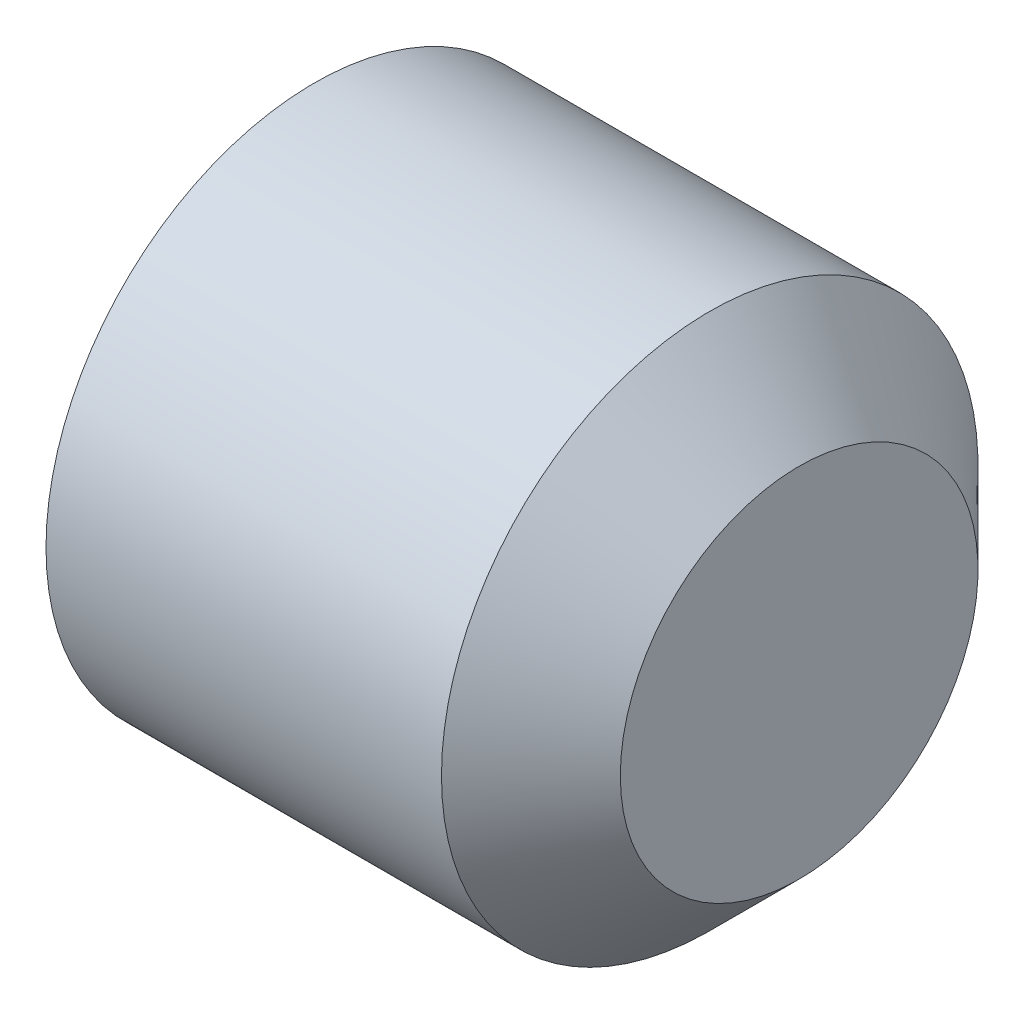
ISO-10303-21;
HEADER;
FILE_DESCRIPTION(('STEP AP214'),'2;1');
FILE_NAME('part.step','',(''),(''),'','','');
FILE_SCHEMA(('AUTOMOTIVE_DESIGN { 1 0 10303 214 1 1 1 1 }'));
ENDSEC;
DATA;
#1=APPLICATION_CONTEXT('core data for automotive mechanical design processes');
#2=APPLICATION_PROTOCOL_DEFINITION('international standard','automotive_design',2000,#1);
#3=PRODUCT_CONTEXT('',#1,'mechanical');
#4=PRODUCT('Part','Part','',(#3));
#5=PRODUCT_RELATED_PRODUCT_CATEGORY('part','',(#4));
#6=PRODUCT_DEFINITION_FORMATION('','',#4);
#7=PRODUCT_DEFINITION_CONTEXT('part definition',#1,'design');
#8=PRODUCT_DEFINITION('design','',#6,#7);
#9=PRODUCT_DEFINITION_SHAPE('','',#8);
#10=(LENGTH_UNIT() NAMED_UNIT(*) SI_UNIT(.MILLI.,.METRE.));
#11=(NAMED_UNIT(*) PLANE_ANGLE_UNIT() SI_UNIT($,.RADIAN.));
#12=(NAMED_UNIT(*) SI_UNIT($,.STERADIAN.) SOLID_ANGLE_UNIT());
#13=UNCERTAINTY_MEASURE_WITH_UNIT(LENGTH_MEASURE(1.E-05),#10,'distance_accuracy_value','');
#14=(GEOMETRIC_REPRESENTATION_CONTEXT(3) GLOBAL_UNCERTAINTY_ASSIGNED_CONTEXT((#13)) GLOBAL_UNIT_ASSIGNED_CONTEXT((#10,
#11,#12)) REPRESENTATION_CONTEXT('',''));
#15=CARTESIAN_POINT('',(0.,0.,0.));
#16=DIRECTION('',(0.,0.,1.));
#17=DIRECTION('',(1.,0.,0.));
#18=AXIS2_PLACEMENT_3D('',#15,#16,#17);
#19=CARTESIAN_POINT('',(0.,0.,0.));
#20=DIRECTION('',(-1.,0.,0.));
#21=DIRECTION('',(0.,0.,1.));
#22=AXIS2_PLACEMENT_3D('',#19,#20,#21);
#23=PLANE('',#22);
#24=DIRECTION('',(0.,0.,-1.));
#25=VECTOR('',#24,1.);
#26=CARTESIAN_POINT('',(0.,1.6,0.866025403784434));
#27=LINE('',#26,#25);
#28=CARTESIAN_POINT('',(0.,1.6,-0.923760430703405));
#29=VERTEX_POINT('',#28);
#30=CARTESIAN_POINT('',(0.,1.6,0.923760430703397));
#31=VERTEX_POINT('',#30);
#32=EDGE_CURVE('E52',#29,#31,#27,.F.);
#33=ORIENTED_EDGE('',*,*,#32,.T.);
#34=DIRECTION('',(0.,0.866025403784438,-0.5));
#35=VECTOR('',#34,1.);
#36=CARTESIAN_POINT('',(0.,0.0500000000000042,1.81865334794732));
#37=LINE('',#36,#35);
#38=CARTESIAN_POINT('',(0.,0.,1.8475208614068));
#39=VERTEX_POINT('',#38);
#40=EDGE_CURVE('E44',#31,#39,#37,.F.);
#41=ORIENTED_EDGE('',*,*,#40,.T.);
#42=DIRECTION('',(0.,0.866025403784439,0.5));
#43=VECTOR('',#42,1.);
#44=CARTESIAN_POINT('',(0.,-1.54999999999999,0.952627944162879));
#45=LINE('',#44,#43);
#46=CARTESIAN_POINT('',(0.,-1.59999999999999,0.923760430703398));
#47=VERTEX_POINT('',#46);
#48=EDGE_CURVE('E184',#39,#47,#45,.F.);
#49=ORIENTED_EDGE('',*,*,#48,.T.);
#50=DIRECTION('',(0.,0.,1.));
#51=VECTOR('',#50,1.);
#52=CARTESIAN_POINT('',(0.,-1.59999999999999,-0.866025403784441));
#53=LINE('',#52,#51);
#54=CARTESIAN_POINT('',(0.,-1.59999999999999,-0.923760430703403));
#55=VERTEX_POINT('',#54);
#56=EDGE_CURVE('E186',#47,#55,#53,.F.);
#57=ORIENTED_EDGE('',*,*,#56,.T.);
#58=DIRECTION('',(0.,-0.866025403784438,0.500000000000001));
#59=VECTOR('',#58,1.);
#60=CARTESIAN_POINT('',(0.,-0.0499999999999965,-1.81865334794732));
#61=LINE('',#60,#59);
#62=CARTESIAN_POINT('',(0.,0.,-1.84752086140681));
#63=VERTEX_POINT('',#62);
#64=EDGE_CURVE('E188',#55,#63,#61,.F.);
#65=ORIENTED_EDGE('',*,*,#64,.T.);
#66=DIRECTION('',(0.,-0.866025403784439,-0.5));
#67=VECTOR('',#66,1.);
#68=CARTESIAN_POINT('',(0.,1.55,-0.952627944162886));
#69=LINE('',#68,#67);
#70=EDGE_CURVE('E57',#63,#29,#69,.F.);
#71=ORIENTED_EDGE('',*,*,#70,.T.);
#72=EDGE_LOOP('',(#33,#41,#49,#57,#65,#71));
#73=FACE_BOUND('',#72,.T.);
#74=CARTESIAN_POINT('',(0.,0.,0.));
#75=DIRECTION('',(-1.,0.,0.));
#76=DIRECTION('',(0.,0.,1.));
#77=AXIS2_PLACEMENT_3D('',#74,#75,#76);
#78=CIRCLE('',#77,1.97320508076302);
#79=CARTESIAN_POINT('',(0.,0.,1.97320508076302));
#80=VERTEX_POINT('',#79);
#81=EDGE_CURVE('E181',#80,#80,#78,.T.);
#82=ORIENTED_EDGE('',*,*,#81,.T.);
#83=EDGE_LOOP('',(#82));
#84=FACE_BOUND('',#83,.T.);
#85=ADVANCED_FACE('F35',(#73,#84),#23,.T.);
#86=CARTESIAN_POINT('',(6.,0.,0.));
#87=DIRECTION('',(-1.,0.,0.));
#88=DIRECTION('',(0.,0.,1.));
#89=AXIS2_PLACEMENT_3D('',#86,#87,#88);
#90=CYLINDRICAL_SURFACE('',#89,3.00000000000659);
#91=CARTESIAN_POINT('',(0.577350269200927,0.,0.));
#92=DIRECTION('',(-1.,0.,0.));
#93=DIRECTION('',(0.,0.,1.));
#94=AXIS2_PLACEMENT_3D('',#91,#92,#93);
#95=CIRCLE('',#94,3.00000000000659);
#96=CARTESIAN_POINT('',(0.577350269200927,0.,3.00000000000659));
#97=VERTEX_POINT('',#96);
#98=EDGE_CURVE('E146',#97,#97,#95,.F.);
#99=ORIENTED_EDGE('',*,*,#98,.T.);
#100=EDGE_LOOP('',(#99));
#101=FACE_BOUND('',#100,.T.);
#102=CARTESIAN_POINT('',(4.99999999999341,0.,0.));
#103=DIRECTION('',(-1.,0.,0.));
#104=DIRECTION('',(0.,0.,1.));
#105=AXIS2_PLACEMENT_3D('',#102,#103,#104);
#106=CIRCLE('',#105,3.00000000000659);
#107=CARTESIAN_POINT('',(4.99999999999341,0.,3.00000000000659));
#108=VERTEX_POINT('',#107);
#109=EDGE_CURVE('E258',#108,#108,#106,.T.);
#110=ORIENTED_EDGE('',*,*,#109,.T.);
#111=EDGE_LOOP('',(#110));
#112=FACE_BOUND('',#111,.T.);
#113=ADVANCED_FACE('F311',(#101,#112),#90,.T.);
#114=CARTESIAN_POINT('',(4.99999999999341,0.,0.));
#115=DIRECTION('',(-1.,0.,0.));
#116=DIRECTION('',(0.,0.,1.));
#117=AXIS2_PLACEMENT_3D('',#114,#115,#116);
#118=CONICAL_SURFACE('',#117,3.00000000000659,0.78539816339745);
#119=CARTESIAN_POINT('',(6.,0.,0.));
#120=DIRECTION('',(-1.,0.,0.));
#121=DIRECTION('',(0.,0.,1.));
#122=AXIS2_PLACEMENT_3D('',#119,#120,#121);
#123=CIRCLE('',#122,2.);
#124=CARTESIAN_POINT('',(6.,0.,2.));
#125=VERTEX_POINT('',#124);
#126=EDGE_CURVE('E255',#125,#125,#123,.T.);
#127=ORIENTED_EDGE('',*,*,#126,.T.);
#128=EDGE_LOOP('',(#127));
#129=FACE_BOUND('',#128,.T.);
#130=ORIENTED_EDGE('',*,*,#109,.F.);
#131=EDGE_LOOP('',(#130));
#132=FACE_BOUND('',#131,.T.);
#133=ADVANCED_FACE('F316',(#129,#132),#118,.T.);
#134=CARTESIAN_POINT('',(6.,2.,0.));
#135=DIRECTION('',(1.,0.,0.));
#136=DIRECTION('',(0.,0.,-1.));
#137=AXIS2_PLACEMENT_3D('',#134,#135,#136);
#138=PLANE('',#137);
#139=ORIENTED_EDGE('',*,*,#126,.F.);
#140=EDGE_LOOP('',(#139));
#141=FACE_BOUND('',#140,.T.);
#142=ADVANCED_FACE('F355',(#141),#138,.T.);
#143=CARTESIAN_POINT('',(2.,-1.49999999999999,0.866025403784435));
#144=DIRECTION('',(0.,-0.5,0.866025403784439));
#145=DIRECTION('',(0.,-0.866025403784439,-0.5));
#146=AXIS2_PLACEMENT_3D('',#143,#144,#145);
#147=PLANE('',#146);
#148=DIRECTION('',(-1.,0.,0.));
#149=VECTOR('',#148,1.);
#150=CARTESIAN_POINT('',(2.,0.,1.73205080756887));
#151=LINE('',#150,#149);
#152=CARTESIAN_POINT('',(1.9,0.,1.73205080756887));
#153=VERTEX_POINT('',#152);
#154=CARTESIAN_POINT('',(0.1,0.,1.73205080756887));
#155=VERTEX_POINT('',#154);
#156=EDGE_CURVE('E204',#153,#155,#151,.T.);
#157=ORIENTED_EDGE('',*,*,#156,.F.);
#158=DIRECTION('',(0.,0.866025403784439,0.5));
#159=VECTOR('',#158,1.);
#160=CARTESIAN_POINT('',(1.9,-1.49999999999999,0.866025403784435));
#161=LINE('',#160,#159);
#162=CARTESIAN_POINT('',(1.9,-1.49999999999999,0.866025403784435));
#163=VERTEX_POINT('',#162);
#164=EDGE_CURVE('E179',#153,#163,#161,.F.);
#165=ORIENTED_EDGE('',*,*,#164,.T.);
#166=DIRECTION('',(-1.,0.,0.));
#167=VECTOR('',#166,1.);
#168=CARTESIAN_POINT('',(2.,-1.49999999999999,0.866025403784435));
#169=LINE('',#168,#167);
#170=CARTESIAN_POINT('',(0.1,-1.49999999999999,0.866025403784435));
#171=VERTEX_POINT('',#170);
#172=EDGE_CURVE('E243',#163,#171,#169,.T.);
#173=ORIENTED_EDGE('',*,*,#172,.T.);
#174=DIRECTION('',(0.,0.866025403784439,0.5));
#175=VECTOR('',#174,1.);
#176=CARTESIAN_POINT('',(0.1,0.,1.73205080756887));
#177=LINE('',#176,#175);
#178=EDGE_CURVE('E177',#171,#155,#177,.T.);
#179=ORIENTED_EDGE('',*,*,#178,.T.);
#180=EDGE_LOOP('',(#157,#165,#173,#179));
#181=FACE_BOUND('',#180,.T.);
#182=ADVANCED_FACE('F241',(#181),#147,.F.);
#183=CARTESIAN_POINT('',(2.,-1.49999999999999,-0.866025403784441));
#184=DIRECTION('',(0.,-1.,0.));
#185=DIRECTION('',(0.,0.,-1.));
#186=AXIS2_PLACEMENT_3D('',#183,#184,#185);
#187=PLANE('',#186);
#188=ORIENTED_EDGE('',*,*,#172,.F.);
#189=DIRECTION('',(0.,0.,1.));
#190=VECTOR('',#189,1.);
#191=CARTESIAN_POINT('',(1.9,-1.49999999999999,-0.866025403784441));
#192=LINE('',#191,#190);
#193=CARTESIAN_POINT('',(1.9,-1.49999999999999,-0.866025403784441));
#194=VERTEX_POINT('',#193);
#195=EDGE_CURVE('E133',#163,#194,#192,.F.);
#196=ORIENTED_EDGE('',*,*,#195,.T.);
#197=DIRECTION('',(-1.,0.,0.));
#198=VECTOR('',#197,1.);
#199=CARTESIAN_POINT('',(2.,-1.49999999999999,-0.866025403784441));
#200=LINE('',#199,#198);
#201=CARTESIAN_POINT('',(0.1,-1.49999999999999,-0.866025403784441));
#202=VERTEX_POINT('',#201);
#203=EDGE_CURVE('E282',#194,#202,#200,.T.);
#204=ORIENTED_EDGE('',*,*,#203,.T.);
#205=DIRECTION('',(0.,0.,1.));
#206=VECTOR('',#205,1.);
#207=CARTESIAN_POINT('',(0.1,-1.49999999999999,0.866025403784435));
#208=LINE('',#207,#206);
#209=EDGE_CURVE('E152',#202,#171,#208,.T.);
#210=ORIENTED_EDGE('',*,*,#209,.T.);
#211=EDGE_LOOP('',(#188,#196,#204,#210));
#212=FACE_BOUND('',#211,.T.);
#213=ADVANCED_FACE('F281',(#212),#187,.F.);
#214=CARTESIAN_POINT('',(2.,0.,-1.73205080756888));
#215=DIRECTION('',(0.,-0.500000000000001,-0.866025403784438));
#216=DIRECTION('',(0.,0.866025403784438,-0.500000000000001));
#217=AXIS2_PLACEMENT_3D('',#214,#215,#216);
#218=PLANE('',#217);
#219=ORIENTED_EDGE('',*,*,#203,.F.);
#220=DIRECTION('',(0.,-0.866025403784438,0.500000000000001));
#221=VECTOR('',#220,1.);
#222=CARTESIAN_POINT('',(1.9,0.,-1.73205080756888));
#223=LINE('',#222,#221);
#224=CARTESIAN_POINT('',(1.9,0.,-1.73205080756888));
#225=VERTEX_POINT('',#224);
#226=EDGE_CURVE('E162',#194,#225,#223,.F.);
#227=ORIENTED_EDGE('',*,*,#226,.T.);
#228=DIRECTION('',(-1.,0.,0.));
#229=VECTOR('',#228,1.);
#230=CARTESIAN_POINT('',(2.,0.,-1.73205080756888));
#231=LINE('',#230,#229);
#232=CARTESIAN_POINT('',(0.1,0.,-1.73205080756888));
#233=VERTEX_POINT('',#232);
#234=EDGE_CURVE('E284',#225,#233,#231,.T.);
#235=ORIENTED_EDGE('',*,*,#234,.T.);
#236=DIRECTION('',(0.,-0.866025403784438,0.500000000000001));
#237=VECTOR('',#236,1.);
#238=CARTESIAN_POINT('',(0.1,-1.5,-0.86602540378444));
#239=LINE('',#238,#237);
#240=EDGE_CURVE('E160',#233,#202,#239,.T.);
#241=ORIENTED_EDGE('',*,*,#240,.T.);
#242=EDGE_LOOP('',(#219,#227,#235,#241));
#243=FACE_BOUND('',#242,.T.);
#244=ADVANCED_FACE('F283',(#243),#218,.F.);
#245=CARTESIAN_POINT('',(2.,1.5,-0.866025403784442));
#246=DIRECTION('',(0.,0.5,-0.866025403784439));
#247=DIRECTION('',(0.,0.866025403784439,0.5));
#248=AXIS2_PLACEMENT_3D('',#245,#246,#247);
#249=PLANE('',#248);
#250=ORIENTED_EDGE('',*,*,#234,.F.);
#251=DIRECTION('',(0.,-0.866025403784439,-0.5));
#252=VECTOR('',#251,1.);
#253=CARTESIAN_POINT('',(1.9,1.5,-0.866025403784442));
#254=LINE('',#253,#252);
#255=CARTESIAN_POINT('',(1.9,1.5,-0.866025403784442));
#256=VERTEX_POINT('',#255);
#257=EDGE_CURVE('E166',#225,#256,#254,.F.);
#258=ORIENTED_EDGE('',*,*,#257,.T.);
#259=DIRECTION('',(-1.,0.,0.));
#260=VECTOR('',#259,1.);
#261=CARTESIAN_POINT('',(2.,1.5,-0.866025403784442));
#262=LINE('',#261,#260);
#263=CARTESIAN_POINT('',(0.1,1.5,-0.866025403784442));
#264=VERTEX_POINT('',#263);
#265=EDGE_CURVE('E251',#256,#264,#262,.T.);
#266=ORIENTED_EDGE('',*,*,#265,.T.);
#267=DIRECTION('',(0.,-0.866025403784439,-0.5));
#268=VECTOR('',#267,1.);
#269=CARTESIAN_POINT('',(0.1,0.,-1.73205080756888));
#270=LINE('',#269,#268);
#271=EDGE_CURVE('E164',#264,#233,#270,.T.);
#272=ORIENTED_EDGE('',*,*,#271,.T.);
#273=EDGE_LOOP('',(#250,#258,#266,#272));
#274=FACE_BOUND('',#273,.T.);
#275=ADVANCED_FACE('F291',(#274),#249,.F.);
#276=CARTESIAN_POINT('',(2.,1.5,0.866025403784434));
#277=DIRECTION('',(0.,1.,0.));
#278=DIRECTION('',(0.,0.,1.));
#279=AXIS2_PLACEMENT_3D('',#276,#277,#278);
#280=PLANE('',#279);
#281=ORIENTED_EDGE('',*,*,#265,.F.);
#282=DIRECTION('',(0.,0.,-1.));
#283=VECTOR('',#282,1.);
#284=CARTESIAN_POINT('',(1.9,1.5,0.866025403784434));
#285=LINE('',#284,#283);
#286=CARTESIAN_POINT('',(1.9,1.5,0.866025403784434));
#287=VERTEX_POINT('',#286);
#288=EDGE_CURVE('E170',#256,#287,#285,.F.);
#289=ORIENTED_EDGE('',*,*,#288,.T.);
#290=DIRECTION('',(-1.,0.,0.));
#291=VECTOR('',#290,1.);
#292=CARTESIAN_POINT('',(2.,1.5,0.866025403784434));
#293=LINE('',#292,#291);
#294=CARTESIAN_POINT('',(0.1,1.5,0.866025403784434));
#295=VERTEX_POINT('',#294);
#296=EDGE_CURVE('E249',#287,#295,#293,.T.);
#297=ORIENTED_EDGE('',*,*,#296,.T.);
#298=DIRECTION('',(0.,0.,-1.));
#299=VECTOR('',#298,1.);
#300=CARTESIAN_POINT('',(0.1,1.5,-0.866025403784442));
#301=LINE('',#300,#299);
#302=EDGE_CURVE('E168',#295,#264,#301,.T.);
#303=ORIENTED_EDGE('',*,*,#302,.T.);
#304=EDGE_LOOP('',(#281,#289,#297,#303));
#305=FACE_BOUND('',#304,.T.);
#306=ADVANCED_FACE('F342',(#305),#280,.F.);
#307=CARTESIAN_POINT('',(2.,0.,1.73205080756887));
#308=DIRECTION('',(0.,0.5,0.866025403784438));
#309=DIRECTION('',(0.,-0.866025403784438,0.5));
#310=AXIS2_PLACEMENT_3D('',#307,#308,#309);
#311=PLANE('',#310);
#312=ORIENTED_EDGE('',*,*,#296,.F.);
#313=DIRECTION('',(0.,0.866025403784438,-0.5));
#314=VECTOR('',#313,1.);
#315=CARTESIAN_POINT('',(1.9,0.,1.73205080756887));
#316=LINE('',#315,#314);
#317=EDGE_CURVE('E175',#287,#153,#316,.F.);
#318=ORIENTED_EDGE('',*,*,#317,.T.);
#319=ORIENTED_EDGE('',*,*,#156,.T.);
#320=DIRECTION('',(0.,0.866025403784438,-0.5));
#321=VECTOR('',#320,1.);
#322=CARTESIAN_POINT('',(0.1,1.5,0.866025403784434));
#323=LINE('',#322,#321);
#324=EDGE_CURVE('E172',#155,#295,#323,.T.);
#325=ORIENTED_EDGE('',*,*,#324,.T.);
#326=EDGE_LOOP('',(#312,#318,#319,#325));
#327=FACE_BOUND('',#326,.T.);
#328=ADVANCED_FACE('F246',(#327),#311,.F.);
#329=CARTESIAN_POINT('',(2.,0.,0.));
#330=DIRECTION('',(-1.,0.,0.));
#331=DIRECTION('',(0.,0.,1.));
#332=AXIS2_PLACEMENT_3D('',#329,#330,#331);
#333=PLANE('',#332);
#334=DIRECTION('',(0.,-0.866025403784438,0.500000000000001));
#335=VECTOR('',#334,1.);
#336=CARTESIAN_POINT('',(2.,-0.700000000000001,-1.21243556529821));
#337=LINE('',#336,#335);
#338=CARTESIAN_POINT('',(2.,0.,-1.61658075373095));
#339=VERTEX_POINT('',#338);
#340=CARTESIAN_POINT('',(2.,-1.39999999999999,-0.808290376865478));
#341=VERTEX_POINT('',#340);
#342=EDGE_CURVE('E150',#339,#341,#337,.T.);
#343=ORIENTED_EDGE('',*,*,#342,.T.);
#344=DIRECTION('',(0.,0.,1.));
#345=VECTOR('',#344,1.);
#346=CARTESIAN_POINT('',(2.,-1.39999999999999,0.));
#347=LINE('',#346,#345);
#348=CARTESIAN_POINT('',(2.,-1.39999999999999,0.808290376865473));
#349=VERTEX_POINT('',#348);
#350=EDGE_CURVE('E131',#341,#349,#347,.T.);
#351=ORIENTED_EDGE('',*,*,#350,.T.);
#352=DIRECTION('',(0.,0.866025403784439,0.5));
#353=VECTOR('',#352,1.);
#354=CARTESIAN_POINT('',(2.,-0.699999999999997,1.21243556529821));
#355=LINE('',#354,#353);
#356=CARTESIAN_POINT('',(2.,0.,1.61658075373095));
#357=VERTEX_POINT('',#356);
#358=EDGE_CURVE('E139',#349,#357,#355,.T.);
#359=ORIENTED_EDGE('',*,*,#358,.T.);
#360=DIRECTION('',(0.,0.866025403784438,-0.5));
#361=VECTOR('',#360,1.);
#362=CARTESIAN_POINT('',(2.,0.699999999999999,1.21243556529821));
#363=LINE('',#362,#361);
#364=CARTESIAN_POINT('',(2.,1.4,0.808290376865472));
#365=VERTEX_POINT('',#364);
#366=EDGE_CURVE('E145',#357,#365,#363,.T.);
#367=ORIENTED_EDGE('',*,*,#366,.T.);
#368=DIRECTION('',(0.,0.,-1.));
#369=VECTOR('',#368,1.);
#370=CARTESIAN_POINT('',(2.,1.4,0.));
#371=LINE('',#370,#369);
#372=CARTESIAN_POINT('',(2.,1.4,-0.808290376865479));
#373=VERTEX_POINT('',#372);
#374=EDGE_CURVE('E264',#365,#373,#371,.T.);
#375=ORIENTED_EDGE('',*,*,#374,.T.);
#376=DIRECTION('',(0.,-0.866025403784439,-0.5));
#377=VECTOR('',#376,1.);
#378=CARTESIAN_POINT('',(2.,0.700000000000002,-1.21243556529822));
#379=LINE('',#378,#377);
#380=EDGE_CURVE('E155',#373,#339,#379,.T.);
#381=ORIENTED_EDGE('',*,*,#380,.T.);
#382=EDGE_LOOP('',(#343,#351,#359,#367,#375,#381));
#383=FACE_BOUND('',#382,.T.);
#384=ADVANCED_FACE('F148',(#383),#333,.T.);
#385=CARTESIAN_POINT('',(0.,0.,0.));
#386=DIRECTION('',(1.,0.,0.));
#387=DIRECTION('',(0.,0.,-1.));
#388=AXIS2_PLACEMENT_3D('',#385,#386,#387);
#389=CONICAL_SURFACE('',#388,2.00000000000659,1.04719755118812);
#390=CARTESIAN_POINT('',(0.0133974596219794,0.,0.));
#391=DIRECTION('',(-1.,0.,0.));
#392=DIRECTION('',(0.,0.,1.));
#393=AXIS2_PLACEMENT_3D('',#390,#391,#392);
#394=CIRCLE('',#393,2.02320508076376);
#395=CARTESIAN_POINT('',(0.0133974596219794,0.,2.02320508076376));
#396=VERTEX_POINT('',#395);
#397=EDGE_CURVE('E11',#396,#396,#394,.F.);
#398=ORIENTED_EDGE('',*,*,#397,.T.);
#399=EDGE_LOOP('',(#398));
#400=FACE_BOUND('',#399,.T.);
#401=ORIENTED_EDGE('',*,*,#98,.F.);
#402=EDGE_LOOP('',(#401));
#403=FACE_BOUND('',#402,.T.);
#404=ADVANCED_FACE('F321',(#400,#403),#389,.T.);
#405=CARTESIAN_POINT('',(1.9,1.4,0.));
#406=DIRECTION('',(0.,0.,-1.));
#407=DIRECTION('',(0.,1.,0.));
#408=AXIS2_PLACEMENT_3D('',#405,#406,#407);
#409=CYLINDRICAL_SURFACE('',#408,0.1);
#410=CARTESIAN_POINT('',(1.9,1.4,0.808290376865472));
#411=DIRECTION('',(0.,0.5,-0.866025403784439));
#412=DIRECTION('',(0.,-0.866025403784439,-0.5));
#413=AXIS2_PLACEMENT_3D('',#410,#411,#412);
#414=ELLIPSE('',#413,0.115470053837925,0.1);
#415=EDGE_CURVE('E198',#287,#365,#414,.T.);
#416=ORIENTED_EDGE('',*,*,#415,.F.);
#417=ORIENTED_EDGE('',*,*,#288,.F.);
#418=CARTESIAN_POINT('',(1.9,1.4,-0.808290376865479));
#419=DIRECTION('',(0.,-0.5,-0.866025403784439));
#420=DIRECTION('',(0.,-0.866025403784439,0.5));
#421=AXIS2_PLACEMENT_3D('',#418,#419,#420);
#422=ELLIPSE('',#421,0.115470053837925,0.1);
#423=EDGE_CURVE('E201',#373,#256,#422,.F.);
#424=ORIENTED_EDGE('',*,*,#423,.F.);
#425=ORIENTED_EDGE('',*,*,#374,.F.);
#426=EDGE_LOOP('',(#416,#417,#424,#425));
#427=FACE_BOUND('',#426,.T.);
#428=ADVANCED_FACE('F324',(#427),#409,.F.);
#429=CARTESIAN_POINT('',(1.9,0.700000000000002,-1.21243556529822));
#430=DIRECTION('',(0.,-0.866025403784439,-0.5));
#431=DIRECTION('',(0.,0.5,-0.866025403784439));
#432=AXIS2_PLACEMENT_3D('',#429,#430,#431);
#433=CYLINDRICAL_SURFACE('',#432,0.1);
#434=ORIENTED_EDGE('',*,*,#423,.T.);
#435=ORIENTED_EDGE('',*,*,#257,.F.);
#436=CARTESIAN_POINT('',(1.9,0.,-1.61658075373096));
#437=DIRECTION('',(0.,-1.,0.));
#438=DIRECTION('',(0.,0.,1.));
#439=AXIS2_PLACEMENT_3D('',#436,#437,#438);
#440=ELLIPSE('',#439,0.115470053837925,0.1);
#441=EDGE_CURVE('E195',#339,#225,#440,.F.);
#442=ORIENTED_EDGE('',*,*,#441,.F.);
#443=ORIENTED_EDGE('',*,*,#380,.F.);
#444=EDGE_LOOP('',(#434,#435,#442,#443));
#445=FACE_BOUND('',#444,.T.);
#446=ADVANCED_FACE('F271',(#445),#433,.F.);
#447=CARTESIAN_POINT('',(1.9,0.699999999999999,1.21243556529821));
#448=DIRECTION('',(0.,0.866025403784438,-0.5));
#449=DIRECTION('',(0.,0.5,0.866025403784438));
#450=AXIS2_PLACEMENT_3D('',#447,#448,#449);
#451=CYLINDRICAL_SURFACE('',#450,0.1);
#452=ORIENTED_EDGE('',*,*,#415,.T.);
#453=ORIENTED_EDGE('',*,*,#366,.F.);
#454=CARTESIAN_POINT('',(1.9,0.,1.61658075373095));
#455=DIRECTION('',(0.,1.,0.));
#456=DIRECTION('',(0.,0.,-1.));
#457=AXIS2_PLACEMENT_3D('',#454,#455,#456);
#458=ELLIPSE('',#457,0.115470053837925,0.1);
#459=EDGE_CURVE('E142',#153,#357,#458,.T.);
#460=ORIENTED_EDGE('',*,*,#459,.F.);
#461=ORIENTED_EDGE('',*,*,#317,.F.);
#462=EDGE_LOOP('',(#452,#453,#460,#461));
#463=FACE_BOUND('',#462,.T.);
#464=ADVANCED_FACE('F332',(#463),#451,.F.);
#465=CARTESIAN_POINT('',(1.9,-0.700000000000001,-1.21243556529821));
#466=DIRECTION('',(0.,-0.866025403784438,0.500000000000001));
#467=DIRECTION('',(0.,-0.500000000000001,-0.866025403784438));
#468=AXIS2_PLACEMENT_3D('',#465,#466,#467);
#469=CYLINDRICAL_SURFACE('',#468,0.1);
#470=ORIENTED_EDGE('',*,*,#441,.T.);
#471=ORIENTED_EDGE('',*,*,#226,.F.);
#472=CARTESIAN_POINT('',(1.9,-1.4,-0.808290376865478));
#473=DIRECTION('',(0.,-0.5,0.866025403784439));
#474=DIRECTION('',(0.,0.866025403784439,0.5));
#475=AXIS2_PLACEMENT_3D('',#472,#473,#474);
#476=ELLIPSE('',#475,0.115470053837925,0.1);
#477=EDGE_CURVE('E136',#341,#194,#476,.F.);
#478=ORIENTED_EDGE('',*,*,#477,.F.);
#479=ORIENTED_EDGE('',*,*,#342,.F.);
#480=EDGE_LOOP('',(#470,#471,#478,#479));
#481=FACE_BOUND('',#480,.T.);
#482=ADVANCED_FACE('F274',(#481),#469,.F.);
#483=CARTESIAN_POINT('',(1.9,-0.699999999999997,1.21243556529821));
#484=DIRECTION('',(0.,0.866025403784439,0.5));
#485=DIRECTION('',(0.,-0.5,0.866025403784439));
#486=AXIS2_PLACEMENT_3D('',#483,#484,#485);
#487=CYLINDRICAL_SURFACE('',#486,0.1);
#488=ORIENTED_EDGE('',*,*,#459,.T.);
#489=ORIENTED_EDGE('',*,*,#358,.F.);
#490=CARTESIAN_POINT('',(1.9,-1.4,0.808290376865473));
#491=DIRECTION('',(0.,0.5,0.866025403784439));
#492=DIRECTION('',(0.,-0.866025403784439,0.5));
#493=AXIS2_PLACEMENT_3D('',#490,#491,#492);
#494=ELLIPSE('',#493,0.115470053837925,0.1);
#495=EDGE_CURVE('E127',#163,#349,#494,.T.);
#496=ORIENTED_EDGE('',*,*,#495,.F.);
#497=ORIENTED_EDGE('',*,*,#164,.F.);
#498=EDGE_LOOP('',(#488,#489,#496,#497));
#499=FACE_BOUND('',#498,.T.);
#500=ADVANCED_FACE('F140',(#499),#487,.F.);
#501=CARTESIAN_POINT('',(1.9,-1.39999999999999,0.));
#502=DIRECTION('',(0.,0.,1.));
#503=DIRECTION('',(0.,-1.,0.));
#504=AXIS2_PLACEMENT_3D('',#501,#502,#503);
#505=CYLINDRICAL_SURFACE('',#504,0.1);
#506=ORIENTED_EDGE('',*,*,#477,.T.);
#507=ORIENTED_EDGE('',*,*,#195,.F.);
#508=ORIENTED_EDGE('',*,*,#495,.T.);
#509=ORIENTED_EDGE('',*,*,#350,.F.);
#510=EDGE_LOOP('',(#506,#507,#508,#509));
#511=FACE_BOUND('',#510,.T.);
#512=ADVANCED_FACE('F129',(#511),#505,.F.);
#513=CARTESIAN_POINT('',(0.1,-0.0499999999999965,-1.81865334794732));
#514=DIRECTION('',(0.,0.866025403784438,-0.500000000000001));
#515=DIRECTION('',(0.,0.500000000000001,0.866025403784438));
#516=AXIS2_PLACEMENT_3D('',#513,#514,#515);
#517=CYLINDRICAL_SURFACE('',#516,0.1);
#518=CARTESIAN_POINT('',(0.1,0.,-1.84752086140681));
#519=DIRECTION('',(0.,1.,0.));
#520=DIRECTION('',(0.,0.,1.));
#521=AXIS2_PLACEMENT_3D('',#518,#519,#520);
#522=ELLIPSE('',#521,0.115470053837925,0.1);
#523=EDGE_CURVE('E214',#63,#233,#522,.T.);
#524=ORIENTED_EDGE('',*,*,#523,.F.);
#525=ORIENTED_EDGE('',*,*,#64,.F.);
#526=CARTESIAN_POINT('',(0.1,-1.59999999999999,-0.923760430703403));
#527=DIRECTION('',(0.,0.5,-0.866025403784439));
#528=DIRECTION('',(0.,0.866025403784439,0.5));
#529=AXIS2_PLACEMENT_3D('',#526,#527,#528);
#530=ELLIPSE('',#529,0.115470053837925,0.1);
#531=EDGE_CURVE('E39',#202,#55,#530,.F.);
#532=ORIENTED_EDGE('',*,*,#531,.F.);
#533=ORIENTED_EDGE('',*,*,#240,.F.);
#534=EDGE_LOOP('',(#524,#525,#532,#533));
#535=FACE_BOUND('',#534,.T.);
#536=ADVANCED_FACE('F229',(#535),#517,.T.);
#537=CARTESIAN_POINT('',(0.1,-1.59999999999999,-0.866025403784441));
#538=DIRECTION('',(0.,0.,-1.));
#539=DIRECTION('',(0.,1.,0.));
#540=AXIS2_PLACEMENT_3D('',#537,#538,#539);
#541=CYLINDRICAL_SURFACE('',#540,0.1);
#542=ORIENTED_EDGE('',*,*,#531,.T.);
#543=ORIENTED_EDGE('',*,*,#56,.F.);
#544=CARTESIAN_POINT('',(0.1,-1.59999999999999,0.923760430703397));
#545=DIRECTION('',(0.,-0.5,-0.866025403784439));
#546=DIRECTION('',(0.,0.866025403784439,-0.5));
#547=AXIS2_PLACEMENT_3D('',#544,#545,#546);
#548=ELLIPSE('',#547,0.115470053837925,0.1);
#549=EDGE_CURVE('E212',#171,#47,#548,.F.);
#550=ORIENTED_EDGE('',*,*,#549,.F.);
#551=ORIENTED_EDGE('',*,*,#209,.F.);
#552=EDGE_LOOP('',(#542,#543,#550,#551));
#553=FACE_BOUND('',#552,.T.);
#554=ADVANCED_FACE('F224',(#553),#541,.T.);
#555=CARTESIAN_POINT('',(0.1,1.55,-0.952627944162886));
#556=DIRECTION('',(0.,0.866025403784439,0.5));
#557=DIRECTION('',(0.,-0.5,0.866025403784439));
#558=AXIS2_PLACEMENT_3D('',#555,#556,#557);
#559=CYLINDRICAL_SURFACE('',#558,0.1);
#560=ORIENTED_EDGE('',*,*,#523,.T.);
#561=ORIENTED_EDGE('',*,*,#271,.F.);
#562=CARTESIAN_POINT('',(0.1,1.6,-0.923760430703404));
#563=DIRECTION('',(0.,0.5,0.866025403784439));
#564=DIRECTION('',(0.,-0.866025403784439,0.5));
#565=AXIS2_PLACEMENT_3D('',#562,#563,#564);
#566=ELLIPSE('',#565,0.115470053837925,0.1);
#567=EDGE_CURVE('E209',#29,#264,#566,.T.);
#568=ORIENTED_EDGE('',*,*,#567,.F.);
#569=ORIENTED_EDGE('',*,*,#70,.F.);
#570=EDGE_LOOP('',(#560,#561,#568,#569));
#571=FACE_BOUND('',#570,.T.);
#572=ADVANCED_FACE('F294',(#571),#559,.T.);
#573=CARTESIAN_POINT('',(0.1,-1.54999999999999,0.952627944162879));
#574=DIRECTION('',(0.,-0.866025403784439,-0.5));
#575=DIRECTION('',(0.,0.5,-0.866025403784439));
#576=AXIS2_PLACEMENT_3D('',#573,#574,#575);
#577=CYLINDRICAL_SURFACE('',#576,0.1);
#578=ORIENTED_EDGE('',*,*,#549,.T.);
#579=ORIENTED_EDGE('',*,*,#48,.F.);
#580=CARTESIAN_POINT('',(0.1,0.,1.8475208614068));
#581=DIRECTION('',(0.,-1.,0.));
#582=DIRECTION('',(0.,0.,1.));
#583=AXIS2_PLACEMENT_3D('',#580,#581,#582);
#584=ELLIPSE('',#583,0.115470053837925,0.1);
#585=EDGE_CURVE('E207',#155,#39,#584,.F.);
#586=ORIENTED_EDGE('',*,*,#585,.F.);
#587=ORIENTED_EDGE('',*,*,#178,.F.);
#588=EDGE_LOOP('',(#578,#579,#586,#587));
#589=FACE_BOUND('',#588,.T.);
#590=ADVANCED_FACE('F234',(#589),#577,.T.);
#591=CARTESIAN_POINT('',(0.1,1.6,0.866025403784434));
#592=DIRECTION('',(0.,0.,1.));
#593=DIRECTION('',(0.,-1.,0.));
#594=AXIS2_PLACEMENT_3D('',#591,#592,#593);
#595=CYLINDRICAL_SURFACE('',#594,0.1);
#596=ORIENTED_EDGE('',*,*,#567,.T.);
#597=ORIENTED_EDGE('',*,*,#302,.F.);
#598=CARTESIAN_POINT('',(0.1,1.6,0.923760430703397));
#599=DIRECTION('',(0.,-0.5,0.866025403784439));
#600=DIRECTION('',(0.,-0.866025403784439,-0.5));
#601=AXIS2_PLACEMENT_3D('',#598,#599,#600);
#602=ELLIPSE('',#601,0.115470053837925,0.1);
#603=EDGE_CURVE('E205',#31,#295,#602,.T.);
#604=ORIENTED_EDGE('',*,*,#603,.F.);
#605=ORIENTED_EDGE('',*,*,#32,.F.);
#606=EDGE_LOOP('',(#596,#597,#604,#605));
#607=FACE_BOUND('',#606,.T.);
#608=ADVANCED_FACE('F297',(#607),#595,.T.);
#609=CARTESIAN_POINT('',(0.1,0.0500000000000041,1.81865334794732));
#610=DIRECTION('',(0.,-0.866025403784438,0.5));
#611=DIRECTION('',(0.,-0.5,-0.866025403784438));
#612=AXIS2_PLACEMENT_3D('',#609,#610,#611);
#613=CYLINDRICAL_SURFACE('',#612,0.1);
#614=ORIENTED_EDGE('',*,*,#585,.T.);
#615=ORIENTED_EDGE('',*,*,#40,.F.);
#616=ORIENTED_EDGE('',*,*,#603,.T.);
#617=ORIENTED_EDGE('',*,*,#324,.F.);
#618=EDGE_LOOP('',(#614,#615,#616,#617));
#619=FACE_BOUND('',#618,.T.);
#620=ADVANCED_FACE('F300',(#619),#613,.T.);
#621=CARTESIAN_POINT('',(0.1,0.,0.));
#622=DIRECTION('',(-1.,0.,0.));
#623=DIRECTION('',(0.,0.,1.));
#624=AXIS2_PLACEMENT_3D('',#621,#622,#623);
#625=TOROIDAL_SURFACE('',#624,1.97320508076302,0.1);
#626=ORIENTED_EDGE('',*,*,#397,.F.);
#627=EDGE_LOOP('',(#626));
#628=FACE_BOUND('',#627,.T.);
#629=ORIENTED_EDGE('',*,*,#81,.F.);
#630=EDGE_LOOP('',(#629));
#631=FACE_BOUND('',#630,.T.);
#632=ADVANCED_FACE('F37',(#628,#631),#625,.T.);
#633=CLOSED_SHELL('',(#85,#113,#133,#142,#182,#213,#244,#275,#306,#328,#384,#404,#428,#446,#464,
#482,#500,#512,#536,#554,#572,#590,#608,#620,#632));
#634=MANIFOLD_SOLID_BREP('B2',#633);
#635=ADVANCED_BREP_SHAPE_REPRESENTATION('',(#18,#634),#14);
#636=SHAPE_DEFINITION_REPRESENTATION(#9,#635);
ENDSEC;
END-ISO-10303-21;
